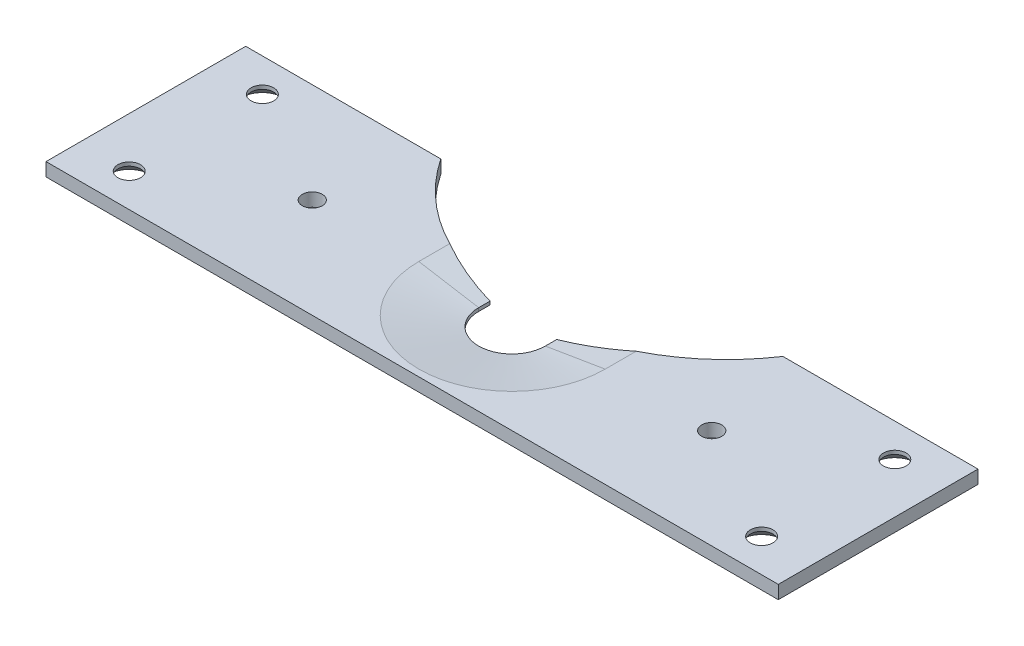
ISO-10303-21;
HEADER;
FILE_DESCRIPTION(('STEP AP214'),'2;1');
FILE_NAME('part.step','',(''),(''),'','','');
FILE_SCHEMA(('AUTOMOTIVE_DESIGN { 1 0 10303 214 1 1 1 1 }'));
ENDSEC;
DATA;
#1=APPLICATION_CONTEXT('core data for automotive mechanical design processes');
#2=APPLICATION_PROTOCOL_DEFINITION('international standard','automotive_design',2000,#1);
#3=PRODUCT_CONTEXT('',#1,'mechanical');
#4=PRODUCT('Part','Part','',(#3));
#5=PRODUCT_RELATED_PRODUCT_CATEGORY('part','',(#4));
#6=PRODUCT_DEFINITION_FORMATION('','',#4);
#7=PRODUCT_DEFINITION_CONTEXT('part definition',#1,'design');
#8=PRODUCT_DEFINITION('design','',#6,#7);
#9=PRODUCT_DEFINITION_SHAPE('','',#8);
#10=(LENGTH_UNIT() NAMED_UNIT(*) SI_UNIT(.MILLI.,.METRE.));
#11=(NAMED_UNIT(*) PLANE_ANGLE_UNIT() SI_UNIT($,.RADIAN.));
#12=(NAMED_UNIT(*) SI_UNIT($,.STERADIAN.) SOLID_ANGLE_UNIT());
#13=UNCERTAINTY_MEASURE_WITH_UNIT(LENGTH_MEASURE(1.E-05),#10,'distance_accuracy_value','');
#14=(GEOMETRIC_REPRESENTATION_CONTEXT(3) GLOBAL_UNCERTAINTY_ASSIGNED_CONTEXT((#13)) GLOBAL_UNIT_ASSIGNED_CONTEXT((#10,
#11,#12)) REPRESENTATION_CONTEXT('',''));
#15=CARTESIAN_POINT('',(0.,0.,0.));
#16=DIRECTION('',(0.,0.,1.));
#17=DIRECTION('',(1.,0.,0.));
#18=AXIS2_PLACEMENT_3D('',#15,#16,#17);
#19=CARTESIAN_POINT('',(-55.,2.,15.));
#20=DIRECTION('',(0.,1.,0.));
#21=DIRECTION('',(0.,0.,1.));
#22=AXIS2_PLACEMENT_3D('',#19,#20,#21);
#23=PLANE('',#22);
#24=CARTESIAN_POINT('',(0.,2.00000000000005,-32.2709623555184));
#25=DIRECTION('',(0.,-1.,0.));
#26=DIRECTION('',(0.,0.,-1.));
#27=AXIS2_PLACEMENT_3D('',#24,#25,#26);
#28=CIRCLE('',#27,30.9632394202983);
#29=CARTESIAN_POINT('',(25.6989504593666,2.00000000000005,-15.));
#30=VERTEX_POINT('',#29);
#31=CARTESIAN_POINT('',(14.0000000000005,2.00000000000005,-4.65353678037294));
#32=VERTEX_POINT('',#31);
#33=EDGE_CURVE('E118',#30,#32,#28,.T.);
#34=ORIENTED_EDGE('',*,*,#33,.T.);
#35=DIRECTION('',(0.,0.,1.));
#36=VECTOR('',#35,1.);
#37=CARTESIAN_POINT('',(14.0000000000002,2.,0.));
#38=LINE('',#37,#36);
#39=CARTESIAN_POINT('',(14.0000000000002,2.,0.));
#40=VERTEX_POINT('',#39);
#41=EDGE_CURVE('E166',#32,#40,#38,.T.);
#42=ORIENTED_EDGE('',*,*,#41,.T.);
#43=CARTESIAN_POINT('',(0.,2.,0.));
#44=DIRECTION('',(0.,1.,0.));
#45=DIRECTION('',(0.,0.,1.));
#46=AXIS2_PLACEMENT_3D('',#43,#44,#45);
#47=CIRCLE('',#46,14.0000000000002);
#48=CARTESIAN_POINT('',(-14.0000000000002,2.,0.));
#49=VERTEX_POINT('',#48);
#50=EDGE_CURVE('E164',#40,#49,#47,.F.);
#51=ORIENTED_EDGE('',*,*,#50,.T.);
#52=DIRECTION('',(0.,0.,-1.));
#53=VECTOR('',#52,1.);
#54=CARTESIAN_POINT('',(-14.0000000000002,2.,-15.));
#55=LINE('',#54,#53);
#56=CARTESIAN_POINT('',(-14.0000000000002,2.,-4.65353678037294));
#57=VERTEX_POINT('',#56);
#58=EDGE_CURVE('E161',#49,#57,#55,.T.);
#59=ORIENTED_EDGE('',*,*,#58,.T.);
#60=CARTESIAN_POINT('',(-25.6989504593666,2.00000000000005,-15.));
#61=VERTEX_POINT('',#60);
#62=EDGE_CURVE('E47',#57,#61,#28,.T.);
#63=ORIENTED_EDGE('',*,*,#62,.T.);
#64=DIRECTION('',(-1.,0.,0.));
#65=VECTOR('',#64,1.);
#66=CARTESIAN_POINT('',(-55.,2.,-15.));
#67=LINE('',#66,#65);
#68=CARTESIAN_POINT('',(-55.,2.,-15.));
#69=VERTEX_POINT('',#68);
#70=EDGE_CURVE('E143',#61,#69,#67,.T.);
#71=ORIENTED_EDGE('',*,*,#70,.T.);
#72=DIRECTION('',(0.,0.,1.));
#73=VECTOR('',#72,1.);
#74=CARTESIAN_POINT('',(-55.,2.,-15.));
#75=LINE('',#74,#73);
#76=CARTESIAN_POINT('',(-55.,2.,15.));
#77=VERTEX_POINT('',#76);
#78=EDGE_CURVE('E222',#69,#77,#75,.T.);
#79=ORIENTED_EDGE('',*,*,#78,.T.);
#80=DIRECTION('',(1.,0.,0.));
#81=VECTOR('',#80,1.);
#82=CARTESIAN_POINT('',(-55.,2.,15.));
#83=LINE('',#82,#81);
#84=CARTESIAN_POINT('',(55.,2.,15.));
#85=VERTEX_POINT('',#84);
#86=EDGE_CURVE('E224',#77,#85,#83,.T.);
#87=ORIENTED_EDGE('',*,*,#86,.T.);
#88=DIRECTION('',(0.,0.,-1.));
#89=VECTOR('',#88,1.);
#90=CARTESIAN_POINT('',(55.,2.,-15.));
#91=LINE('',#90,#89);
#92=CARTESIAN_POINT('',(55.,2.,-15.));
#93=VERTEX_POINT('',#92);
#94=EDGE_CURVE('E140',#85,#93,#91,.T.);
#95=ORIENTED_EDGE('',*,*,#94,.T.);
#96=EDGE_CURVE('E132',#93,#30,#67,.T.);
#97=ORIENTED_EDGE('',*,*,#96,.T.);
#98=EDGE_LOOP('',(#34,#42,#51,#59,#63,#71,#79,#87,#95,#97));
#99=FACE_BOUND('',#98,.T.);
#100=CARTESIAN_POINT('',(29.9999999999998,2.,0.));
#101=DIRECTION('',(0.,1.,0.));
#102=DIRECTION('',(0.,0.,1.));
#103=AXIS2_PLACEMENT_3D('',#100,#101,#102);
#104=CIRCLE('',#103,1.49999999999999);
#105=CARTESIAN_POINT('',(29.9999999999998,2.,1.49999999999994));
#106=VERTEX_POINT('',#105);
#107=EDGE_CURVE('E245',#106,#106,#104,.T.);
#108=ORIENTED_EDGE('',*,*,#107,.F.);
#109=EDGE_LOOP('',(#108));
#110=FACE_BOUND('',#109,.T.);
#111=CARTESIAN_POINT('',(-30.,2.,0.));
#112=DIRECTION('',(0.,1.,0.));
#113=DIRECTION('',(0.,0.,1.));
#114=AXIS2_PLACEMENT_3D('',#111,#112,#113);
#115=CIRCLE('',#114,1.49999999999999);
#116=CARTESIAN_POINT('',(-30.,2.,1.49999999999999));
#117=VERTEX_POINT('',#116);
#118=EDGE_CURVE('E251',#117,#117,#115,.T.);
#119=ORIENTED_EDGE('',*,*,#118,.F.);
#120=EDGE_LOOP('',(#119));
#121=FACE_BOUND('',#120,.T.);
#122=CARTESIAN_POINT('',(-47.5,2.00000000000005,-10.));
#123=DIRECTION('',(0.,-1.,0.));
#124=DIRECTION('',(0.,0.,-1.));
#125=AXIS2_PLACEMENT_3D('',#122,#123,#124);
#126=CIRCLE('',#125,1.7);
#127=CARTESIAN_POINT('',(-47.5,2.00000000000005,-11.7));
#128=VERTEX_POINT('',#127);
#129=EDGE_CURVE('E266',#128,#128,#126,.T.);
#130=ORIENTED_EDGE('',*,*,#129,.T.);
#131=EDGE_LOOP('',(#130));
#132=FACE_BOUND('',#131,.T.);
#133=CARTESIAN_POINT('',(47.5,2.00000000000005,10.));
#134=DIRECTION('',(0.,-1.,0.));
#135=DIRECTION('',(0.,0.,-1.));
#136=AXIS2_PLACEMENT_3D('',#133,#134,#135);
#137=CIRCLE('',#136,1.7);
#138=CARTESIAN_POINT('',(47.5,2.00000000000005,8.3));
#139=VERTEX_POINT('',#138);
#140=EDGE_CURVE('E284',#139,#139,#137,.T.);
#141=ORIENTED_EDGE('',*,*,#140,.T.);
#142=EDGE_LOOP('',(#141));
#143=FACE_BOUND('',#142,.T.);
#144=CARTESIAN_POINT('',(-47.5,2.00000000000005,10.));
#145=DIRECTION('',(0.,-1.,0.));
#146=DIRECTION('',(0.,0.,-1.));
#147=AXIS2_PLACEMENT_3D('',#144,#145,#146);
#148=CIRCLE('',#147,1.7);
#149=CARTESIAN_POINT('',(-47.5,2.00000000000005,8.3));
#150=VERTEX_POINT('',#149);
#151=EDGE_CURVE('E275',#150,#150,#148,.T.);
#152=ORIENTED_EDGE('',*,*,#151,.T.);
#153=EDGE_LOOP('',(#152));
#154=FACE_BOUND('',#153,.T.);
#155=CARTESIAN_POINT('',(47.5,2.00000000000005,-10.));
#156=DIRECTION('',(0.,-1.,0.));
#157=DIRECTION('',(0.,0.,-1.));
#158=AXIS2_PLACEMENT_3D('',#155,#156,#157);
#159=CIRCLE('',#158,1.7);
#160=CARTESIAN_POINT('',(47.5,2.00000000000005,-11.7));
#161=VERTEX_POINT('',#160);
#162=EDGE_CURVE('E257',#161,#161,#159,.T.);
#163=ORIENTED_EDGE('',*,*,#162,.T.);
#164=EDGE_LOOP('',(#163));
#165=FACE_BOUND('',#164,.T.);
#166=ADVANCED_FACE('F32',(#99,#110,#121,#132,#143,#154,#165),#23,.T.);
#167=CARTESIAN_POINT('',(-55.,2.,-15.));
#168=DIRECTION('',(0.,0.,1.));
#169=DIRECTION('',(1.,0.,0.));
#170=AXIS2_PLACEMENT_3D('',#167,#168,#169);
#171=PLANE('',#170);
#172=ORIENTED_EDGE('',*,*,#70,.F.);
#173=DIRECTION('',(0.,-1.,0.));
#174=VECTOR('',#173,1.);
#175=CARTESIAN_POINT('',(-25.6989504593666,2.00000000000005,-15.));
#176=LINE('',#175,#174);
#177=CARTESIAN_POINT('',(-25.6989504593666,0.,-15.));
#178=VERTEX_POINT('',#177);
#179=EDGE_CURVE('E135',#61,#178,#176,.T.);
#180=ORIENTED_EDGE('',*,*,#179,.T.);
#181=DIRECTION('',(-1.,0.,0.));
#182=VECTOR('',#181,1.);
#183=CARTESIAN_POINT('',(-55.,0.,-15.));
#184=LINE('',#183,#182);
#185=CARTESIAN_POINT('',(-55.,0.,-15.));
#186=VERTEX_POINT('',#185);
#187=EDGE_CURVE('E220',#178,#186,#184,.T.);
#188=ORIENTED_EDGE('',*,*,#187,.T.);
#189=DIRECTION('',(0.,-1.,0.));
#190=VECTOR('',#189,1.);
#191=CARTESIAN_POINT('',(-55.,2.,-15.));
#192=LINE('',#191,#190);
#193=EDGE_CURVE('E142',#69,#186,#192,.T.);
#194=ORIENTED_EDGE('',*,*,#193,.F.);
#195=EDGE_LOOP('',(#172,#180,#188,#194));
#196=FACE_BOUND('',#195,.T.);
#197=ADVANCED_FACE('F299',(#196),#171,.F.);
#198=CARTESIAN_POINT('',(-55.,2.,-15.));
#199=DIRECTION('',(1.,0.,0.));
#200=DIRECTION('',(0.,0.,-1.));
#201=AXIS2_PLACEMENT_3D('',#198,#199,#200);
#202=PLANE('',#201);
#203=DIRECTION('',(0.,0.,1.));
#204=VECTOR('',#203,1.);
#205=CARTESIAN_POINT('',(-55.,0.,-15.));
#206=LINE('',#205,#204);
#207=CARTESIAN_POINT('',(-55.,0.,15.));
#208=VERTEX_POINT('',#207);
#209=EDGE_CURVE('E186',#186,#208,#206,.T.);
#210=ORIENTED_EDGE('',*,*,#209,.T.);
#211=DIRECTION('',(0.,-1.,0.));
#212=VECTOR('',#211,1.);
#213=CARTESIAN_POINT('',(-55.,2.,15.));
#214=LINE('',#213,#212);
#215=EDGE_CURVE('E155',#77,#208,#214,.T.);
#216=ORIENTED_EDGE('',*,*,#215,.F.);
#217=ORIENTED_EDGE('',*,*,#78,.F.);
#218=ORIENTED_EDGE('',*,*,#193,.T.);
#219=EDGE_LOOP('',(#210,#216,#217,#218));
#220=FACE_BOUND('',#219,.T.);
#221=ADVANCED_FACE('F34',(#220),#202,.F.);
#222=CARTESIAN_POINT('',(-55.,2.,15.));
#223=DIRECTION('',(0.,0.,-1.));
#224=DIRECTION('',(-1.,0.,0.));
#225=AXIS2_PLACEMENT_3D('',#222,#223,#224);
#226=PLANE('',#225);
#227=DIRECTION('',(1.,0.,0.));
#228=VECTOR('',#227,1.);
#229=CARTESIAN_POINT('',(-55.,0.,15.));
#230=LINE('',#229,#228);
#231=CARTESIAN_POINT('',(55.,0.,15.));
#232=VERTEX_POINT('',#231);
#233=EDGE_CURVE('E216',#208,#232,#230,.T.);
#234=ORIENTED_EDGE('',*,*,#233,.T.);
#235=DIRECTION('',(0.,-1.,0.));
#236=VECTOR('',#235,1.);
#237=CARTESIAN_POINT('',(55.,2.,15.));
#238=LINE('',#237,#236);
#239=EDGE_CURVE('E152',#85,#232,#238,.T.);
#240=ORIENTED_EDGE('',*,*,#239,.F.);
#241=ORIENTED_EDGE('',*,*,#86,.F.);
#242=ORIENTED_EDGE('',*,*,#215,.T.);
#243=EDGE_LOOP('',(#234,#240,#241,#242));
#244=FACE_BOUND('',#243,.T.);
#245=ADVANCED_FACE('F229',(#244),#226,.F.);
#246=CARTESIAN_POINT('',(55.,2.,-15.));
#247=DIRECTION('',(-1.,0.,0.));
#248=DIRECTION('',(0.,0.,1.));
#249=AXIS2_PLACEMENT_3D('',#246,#247,#248);
#250=PLANE('',#249);
#251=DIRECTION('',(0.,0.,-1.));
#252=VECTOR('',#251,1.);
#253=CARTESIAN_POINT('',(55.,0.,-15.));
#254=LINE('',#253,#252);
#255=CARTESIAN_POINT('',(55.,0.,-15.));
#256=VERTEX_POINT('',#255);
#257=EDGE_CURVE('E218',#232,#256,#254,.T.);
#258=ORIENTED_EDGE('',*,*,#257,.T.);
#259=DIRECTION('',(0.,-1.,0.));
#260=VECTOR('',#259,1.);
#261=CARTESIAN_POINT('',(55.,2.,-15.));
#262=LINE('',#261,#260);
#263=EDGE_CURVE('E146',#93,#256,#262,.T.);
#264=ORIENTED_EDGE('',*,*,#263,.F.);
#265=ORIENTED_EDGE('',*,*,#94,.F.);
#266=ORIENTED_EDGE('',*,*,#239,.T.);
#267=EDGE_LOOP('',(#258,#264,#265,#266));
#268=FACE_BOUND('',#267,.T.);
#269=ADVANCED_FACE('F232',(#268),#250,.F.);
#270=CARTESIAN_POINT('',(25.6989504593666,0.,-15.));
#271=VERTEX_POINT('',#270);
#272=EDGE_CURVE('E134',#256,#271,#184,.T.);
#273=ORIENTED_EDGE('',*,*,#272,.T.);
#274=DIRECTION('',(0.,-1.,0.));
#275=VECTOR('',#274,1.);
#276=CARTESIAN_POINT('',(25.6989504593666,2.00000000000005,-15.));
#277=LINE('',#276,#275);
#278=EDGE_CURVE('E121',#271,#30,#277,.F.);
#279=ORIENTED_EDGE('',*,*,#278,.T.);
#280=ORIENTED_EDGE('',*,*,#96,.F.);
#281=ORIENTED_EDGE('',*,*,#263,.T.);
#282=EDGE_LOOP('',(#273,#279,#280,#281));
#283=FACE_BOUND('',#282,.T.);
#284=ADVANCED_FACE('F130',(#283),#171,.F.);
#285=CARTESIAN_POINT('',(-55.,0.,15.));
#286=DIRECTION('',(0.,1.,0.));
#287=DIRECTION('',(0.,0.,1.));
#288=AXIS2_PLACEMENT_3D('',#285,#286,#287);
#289=PLANE('',#288);
#290=CARTESIAN_POINT('',(29.9999999999998,0.,0.));
#291=DIRECTION('',(0.,1.,0.));
#292=DIRECTION('',(0.,0.,1.));
#293=AXIS2_PLACEMENT_3D('',#290,#291,#292);
#294=CIRCLE('',#293,1.5);
#295=CARTESIAN_POINT('',(29.9999999999998,0.,1.49999999999995));
#296=VERTEX_POINT('',#295);
#297=EDGE_CURVE('E248',#296,#296,#294,.T.);
#298=ORIENTED_EDGE('',*,*,#297,.T.);
#299=EDGE_LOOP('',(#298));
#300=FACE_BOUND('',#299,.T.);
#301=CARTESIAN_POINT('',(-30.,0.,0.));
#302=DIRECTION('',(0.,1.,0.));
#303=DIRECTION('',(0.,0.,1.));
#304=AXIS2_PLACEMENT_3D('',#301,#302,#303);
#305=CIRCLE('',#304,1.5);
#306=CARTESIAN_POINT('',(-30.,0.,1.5));
#307=VERTEX_POINT('',#306);
#308=EDGE_CURVE('E254',#307,#307,#305,.T.);
#309=ORIENTED_EDGE('',*,*,#308,.T.);
#310=EDGE_LOOP('',(#309));
#311=FACE_BOUND('',#310,.T.);
#312=CARTESIAN_POINT('',(47.5,0.,-10.));
#313=DIRECTION('',(0.,-1.,0.));
#314=DIRECTION('',(0.,0.,-1.));
#315=AXIS2_PLACEMENT_3D('',#312,#313,#314);
#316=CIRCLE('',#315,3.15);
#317=CARTESIAN_POINT('',(47.5,0.,-13.15));
#318=VERTEX_POINT('',#317);
#319=EDGE_CURVE('E263',#318,#318,#316,.T.);
#320=ORIENTED_EDGE('',*,*,#319,.F.);
#321=EDGE_LOOP('',(#320));
#322=FACE_BOUND('',#321,.T.);
#323=CARTESIAN_POINT('',(-47.5,0.,-10.));
#324=DIRECTION('',(0.,-1.,0.));
#325=DIRECTION('',(0.,0.,-1.));
#326=AXIS2_PLACEMENT_3D('',#323,#324,#325);
#327=CIRCLE('',#326,3.15);
#328=CARTESIAN_POINT('',(-47.5,0.,-13.15));
#329=VERTEX_POINT('',#328);
#330=EDGE_CURVE('E272',#329,#329,#327,.T.);
#331=ORIENTED_EDGE('',*,*,#330,.F.);
#332=EDGE_LOOP('',(#331));
#333=FACE_BOUND('',#332,.T.);
#334=CARTESIAN_POINT('',(-47.5,0.,10.));
#335=DIRECTION('',(0.,-1.,0.));
#336=DIRECTION('',(0.,0.,-1.));
#337=AXIS2_PLACEMENT_3D('',#334,#335,#336);
#338=CIRCLE('',#337,3.15);
#339=CARTESIAN_POINT('',(-47.5,0.,6.85));
#340=VERTEX_POINT('',#339);
#341=EDGE_CURVE('E281',#340,#340,#338,.T.);
#342=ORIENTED_EDGE('',*,*,#341,.F.);
#343=EDGE_LOOP('',(#342));
#344=FACE_BOUND('',#343,.T.);
#345=CARTESIAN_POINT('',(47.5,0.,10.));
#346=DIRECTION('',(0.,-1.,0.));
#347=DIRECTION('',(0.,0.,-1.));
#348=AXIS2_PLACEMENT_3D('',#345,#346,#347);
#349=CIRCLE('',#348,3.15);
#350=CARTESIAN_POINT('',(47.5,0.,6.85));
#351=VERTEX_POINT('',#350);
#352=EDGE_CURVE('E202',#351,#351,#349,.T.);
#353=ORIENTED_EDGE('',*,*,#352,.F.);
#354=EDGE_LOOP('',(#353));
#355=FACE_BOUND('',#354,.T.);
#356=DIRECTION('',(0.,0.,-1.));
#357=VECTOR('',#356,1.);
#358=CARTESIAN_POINT('',(5.,0.,0.));
#359=LINE('',#358,#357);
#360=CARTESIAN_POINT('',(5.,0.,0.));
#361=VERTEX_POINT('',#360);
#362=CARTESIAN_POINT('',(5.,0.,-1.71409413577583));
#363=VERTEX_POINT('',#362);
#364=EDGE_CURVE('E209',#361,#363,#359,.T.);
#365=ORIENTED_EDGE('',*,*,#364,.T.);
#366=CARTESIAN_POINT('',(0.,0.,-32.2709623555184));
#367=DIRECTION('',(0.,-1.,0.));
#368=DIRECTION('',(0.,0.,-1.));
#369=AXIS2_PLACEMENT_3D('',#366,#367,#368);
#370=CIRCLE('',#369,30.9632394202983);
#371=EDGE_CURVE('E235',#271,#363,#370,.T.);
#372=ORIENTED_EDGE('',*,*,#371,.F.);
#373=ORIENTED_EDGE('',*,*,#272,.F.);
#374=ORIENTED_EDGE('',*,*,#257,.F.);
#375=ORIENTED_EDGE('',*,*,#233,.F.);
#376=ORIENTED_EDGE('',*,*,#209,.F.);
#377=ORIENTED_EDGE('',*,*,#187,.F.);
#378=CARTESIAN_POINT('',(-5.,0.,-1.71409413577583));
#379=VERTEX_POINT('',#378);
#380=EDGE_CURVE('E236',#379,#178,#370,.T.);
#381=ORIENTED_EDGE('',*,*,#380,.F.);
#382=DIRECTION('',(0.,0.,1.));
#383=VECTOR('',#382,1.);
#384=CARTESIAN_POINT('',(-5.,0.,0.));
#385=LINE('',#384,#383);
#386=CARTESIAN_POINT('',(-5.,0.,0.));
#387=VERTEX_POINT('',#386);
#388=EDGE_CURVE('E210',#379,#387,#385,.T.);
#389=ORIENTED_EDGE('',*,*,#388,.T.);
#390=CARTESIAN_POINT('',(0.,0.,0.));
#391=DIRECTION('',(0.,1.,0.));
#392=DIRECTION('',(0.,0.,1.));
#393=AXIS2_PLACEMENT_3D('',#390,#391,#392);
#394=CIRCLE('',#393,5.);
#395=EDGE_CURVE('E185',#387,#361,#394,.T.);
#396=ORIENTED_EDGE('',*,*,#395,.T.);
#397=EDGE_LOOP('',(#365,#372,#373,#374,#375,#376,#377,#381,#389,#396));
#398=FACE_BOUND('',#397,.T.);
#399=ADVANCED_FACE('F234',(#300,#311,#322,#333,#344,#355,#398),#289,.F.);
#400=CARTESIAN_POINT('',(0.,0.,0.));
#401=DIRECTION('',(0.,1.,0.));
#402=DIRECTION('',(0.,0.,1.));
#403=AXIS2_PLACEMENT_3D('',#400,#401,#402);
#404=CYLINDRICAL_SURFACE('',#403,5.);
#405=DIRECTION('',(0.,1.,0.));
#406=VECTOR('',#405,1.);
#407=CARTESIAN_POINT('',(-5.,0.,0.));
#408=LINE('',#407,#406);
#409=CARTESIAN_POINT('',(-5.,0.499999999999999,0.));
#410=VERTEX_POINT('',#409);
#411=EDGE_CURVE('E176',#387,#410,#408,.T.);
#412=ORIENTED_EDGE('',*,*,#411,.T.);
#413=CARTESIAN_POINT('',(0.,0.499999999999999,0.));
#414=DIRECTION('',(0.,1.,0.));
#415=DIRECTION('',(0.,0.,1.));
#416=AXIS2_PLACEMENT_3D('',#413,#414,#415);
#417=CIRCLE('',#416,5.);
#418=CARTESIAN_POINT('',(5.,0.499999999999999,0.));
#419=VERTEX_POINT('',#418);
#420=EDGE_CURVE('E168',#410,#419,#417,.T.);
#421=ORIENTED_EDGE('',*,*,#420,.T.);
#422=DIRECTION('',(0.,1.,0.));
#423=VECTOR('',#422,1.);
#424=CARTESIAN_POINT('',(5.,0.,0.));
#425=LINE('',#424,#423);
#426=EDGE_CURVE('E187',#361,#419,#425,.T.);
#427=ORIENTED_EDGE('',*,*,#426,.F.);
#428=ORIENTED_EDGE('',*,*,#395,.F.);
#429=EDGE_LOOP('',(#412,#421,#427,#428));
#430=FACE_BOUND('',#429,.T.);
#431=ADVANCED_FACE('F181',(#430),#404,.F.);
#432=CARTESIAN_POINT('',(-5.,0.,0.));
#433=DIRECTION('',(-1.,0.,0.));
#434=DIRECTION('',(0.,0.,1.));
#435=AXIS2_PLACEMENT_3D('',#432,#433,#434);
#436=PLANE('',#435);
#437=ORIENTED_EDGE('',*,*,#388,.F.);
#438=DIRECTION('',(0.,-1.,0.));
#439=VECTOR('',#438,1.);
#440=CARTESIAN_POINT('',(-5.,2.00000000000005,-1.71409413577583));
#441=LINE('',#440,#439);
#442=CARTESIAN_POINT('',(-5.,0.499999999999999,-1.71409413577583));
#443=VERTEX_POINT('',#442);
#444=EDGE_CURVE('E136',#379,#443,#441,.F.);
#445=ORIENTED_EDGE('',*,*,#444,.T.);
#446=DIRECTION('',(0.,0.,1.));
#447=VECTOR('',#446,1.);
#448=CARTESIAN_POINT('',(-5.,0.499999999999999,0.));
#449=LINE('',#448,#447);
#450=EDGE_CURVE('E40',#443,#410,#449,.T.);
#451=ORIENTED_EDGE('',*,*,#450,.T.);
#452=ORIENTED_EDGE('',*,*,#411,.F.);
#453=EDGE_LOOP('',(#437,#445,#451,#452));
#454=FACE_BOUND('',#453,.T.);
#455=ADVANCED_FACE('F175',(#454),#436,.F.);
#456=CARTESIAN_POINT('',(5.,0.,0.));
#457=DIRECTION('',(1.,0.,0.));
#458=DIRECTION('',(0.,0.,-1.));
#459=AXIS2_PLACEMENT_3D('',#456,#457,#458);
#460=PLANE('',#459);
#461=DIRECTION('',(0.,0.,-1.));
#462=VECTOR('',#461,1.);
#463=CARTESIAN_POINT('',(5.,0.499999999999999,-15.));
#464=LINE('',#463,#462);
#465=CARTESIAN_POINT('',(5.,0.499999999999999,-1.71409413577583));
#466=VERTEX_POINT('',#465);
#467=EDGE_CURVE('E158',#419,#466,#464,.T.);
#468=ORIENTED_EDGE('',*,*,#467,.T.);
#469=DIRECTION('',(0.,-1.,0.));
#470=VECTOR('',#469,1.);
#471=CARTESIAN_POINT('',(5.,2.00000000000005,-1.71409413577583));
#472=LINE('',#471,#470);
#473=EDGE_CURVE('E54',#466,#363,#472,.T.);
#474=ORIENTED_EDGE('',*,*,#473,.T.);
#475=ORIENTED_EDGE('',*,*,#364,.F.);
#476=ORIENTED_EDGE('',*,*,#426,.T.);
#477=EDGE_LOOP('',(#468,#474,#475,#476));
#478=FACE_BOUND('',#477,.T.);
#479=ADVANCED_FACE('F206',(#478),#460,.F.);
#480=CARTESIAN_POINT('',(-5.,0.499999999999999,0.));
#481=DIRECTION('',(0.164398987305354,0.986393923832144,0.));
#482=DIRECTION('',(-0.986393923832144,0.164398987305354,0.));
#483=AXIS2_PLACEMENT_3D('',#480,#481,#482);
#484=PLANE('',#483);
#485=CARTESIAN_POINT('',(0.,-0.333333333333316,-32.2709623555184));
#486=DIRECTION('',(0.164398987305354,0.986393923832144,0.));
#487=DIRECTION('',(0.986393923832144,-0.164398987305354,0.));
#488=AXIS2_PLACEMENT_3D('',#485,#486,#487);
#489=ELLIPSE('',#488,31.3903387604072,30.9632394202983);
#490=EDGE_CURVE('E240',#57,#443,#489,.T.);
#491=ORIENTED_EDGE('',*,*,#490,.F.);
#492=ORIENTED_EDGE('',*,*,#58,.F.);
#493=DIRECTION('',(-0.986393923832144,0.164398987305354,0.));
#494=VECTOR('',#493,1.);
#495=CARTESIAN_POINT('',(-5.,0.499999999999999,0.));
#496=LINE('',#495,#494);
#497=EDGE_CURVE('E191',#410,#49,#496,.T.);
#498=ORIENTED_EDGE('',*,*,#497,.F.);
#499=ORIENTED_EDGE('',*,*,#450,.F.);
#500=EDGE_LOOP('',(#491,#492,#498,#499));
#501=FACE_BOUND('',#500,.T.);
#502=ADVANCED_FACE('F192',(#501),#484,.T.);
#503=CARTESIAN_POINT('',(0.,0.499999999999999,0.));
#504=DIRECTION('',(0.,1.,0.));
#505=DIRECTION('',(0.,0.,1.));
#506=AXIS2_PLACEMENT_3D('',#503,#504,#505);
#507=CONICAL_SURFACE('',#506,5.,1.40564764938027);
#508=ORIENTED_EDGE('',*,*,#497,.T.);
#509=ORIENTED_EDGE('',*,*,#50,.F.);
#510=DIRECTION('',(0.986393923832144,0.164398987305354,0.));
#511=VECTOR('',#510,1.);
#512=CARTESIAN_POINT('',(5.,0.499999999999999,0.));
#513=LINE('',#512,#511);
#514=EDGE_CURVE('E195',#419,#40,#513,.T.);
#515=ORIENTED_EDGE('',*,*,#514,.F.);
#516=ORIENTED_EDGE('',*,*,#420,.F.);
#517=EDGE_LOOP('',(#508,#509,#515,#516));
#518=FACE_BOUND('',#517,.T.);
#519=ADVANCED_FACE('F198',(#518),#507,.F.);
#520=CARTESIAN_POINT('',(5.,0.499999999999999,0.));
#521=DIRECTION('',(-0.164398987305354,0.986393923832144,0.));
#522=DIRECTION('',(-0.986393923832144,-0.164398987305354,0.));
#523=AXIS2_PLACEMENT_3D('',#520,#521,#522);
#524=PLANE('',#523);
#525=CARTESIAN_POINT('',(0.,-0.333333333333316,-32.2709623555184));
#526=DIRECTION('',(-0.164398987305354,0.986393923832144,0.));
#527=DIRECTION('',(-0.986393923832144,-0.164398987305354,0.));
#528=AXIS2_PLACEMENT_3D('',#525,#526,#527);
#529=ELLIPSE('',#528,31.3903387604072,30.9632394202983);
#530=EDGE_CURVE('E11',#466,#32,#529,.T.);
#531=ORIENTED_EDGE('',*,*,#530,.F.);
#532=ORIENTED_EDGE('',*,*,#467,.F.);
#533=ORIENTED_EDGE('',*,*,#514,.T.);
#534=ORIENTED_EDGE('',*,*,#41,.F.);
#535=EDGE_LOOP('',(#531,#532,#533,#534));
#536=FACE_BOUND('',#535,.T.);
#537=ADVANCED_FACE('F204',(#536),#524,.T.);
#538=CARTESIAN_POINT('',(47.5,0.,10.));
#539=DIRECTION('',(0.,-1.,0.));
#540=DIRECTION('',(0.,0.,-1.));
#541=AXIS2_PLACEMENT_3D('',#538,#539,#540);
#542=CONICAL_SURFACE('',#541,3.15,0.785398163397449);
#543=CARTESIAN_POINT('',(47.5,1.45,10.));
#544=DIRECTION('',(0.,-1.,0.));
#545=DIRECTION('',(0.,0.,-1.));
#546=AXIS2_PLACEMENT_3D('',#543,#544,#545);
#547=CIRCLE('',#546,1.7);
#548=CARTESIAN_POINT('',(47.5,1.45,8.3));
#549=VERTEX_POINT('',#548);
#550=EDGE_CURVE('E287',#549,#549,#547,.T.);
#551=ORIENTED_EDGE('',*,*,#550,.F.);
#552=EDGE_LOOP('',(#551));
#553=FACE_BOUND('',#552,.T.);
#554=ORIENTED_EDGE('',*,*,#352,.T.);
#555=EDGE_LOOP('',(#554));
#556=FACE_BOUND('',#555,.T.);
#557=ADVANCED_FACE('F368',(#553,#556),#542,.F.);
#558=CARTESIAN_POINT('',(47.5,0.,10.));
#559=DIRECTION('',(0.,-1.,0.));
#560=DIRECTION('',(0.,0.,-1.));
#561=AXIS2_PLACEMENT_3D('',#558,#559,#560);
#562=CYLINDRICAL_SURFACE('',#561,1.7);
#563=ORIENTED_EDGE('',*,*,#140,.F.);
#564=EDGE_LOOP('',(#563));
#565=FACE_BOUND('',#564,.T.);
#566=ORIENTED_EDGE('',*,*,#550,.T.);
#567=EDGE_LOOP('',(#566));
#568=FACE_BOUND('',#567,.T.);
#569=ADVANCED_FACE('F375',(#565,#568),#562,.F.);
#570=CARTESIAN_POINT('',(-47.5,0.,10.));
#571=DIRECTION('',(0.,-1.,0.));
#572=DIRECTION('',(0.,0.,-1.));
#573=AXIS2_PLACEMENT_3D('',#570,#571,#572);
#574=CONICAL_SURFACE('',#573,3.15,0.785398163397449);
#575=CARTESIAN_POINT('',(-47.5,1.45,10.));
#576=DIRECTION('',(0.,-1.,0.));
#577=DIRECTION('',(0.,0.,-1.));
#578=AXIS2_PLACEMENT_3D('',#575,#576,#577);
#579=CIRCLE('',#578,1.7);
#580=CARTESIAN_POINT('',(-47.5,1.45,8.3));
#581=VERTEX_POINT('',#580);
#582=EDGE_CURVE('E278',#581,#581,#579,.T.);
#583=ORIENTED_EDGE('',*,*,#582,.F.);
#584=EDGE_LOOP('',(#583));
#585=FACE_BOUND('',#584,.T.);
#586=ORIENTED_EDGE('',*,*,#341,.T.);
#587=EDGE_LOOP('',(#586));
#588=FACE_BOUND('',#587,.T.);
#589=ADVANCED_FACE('F383',(#585,#588),#574,.F.);
#590=CARTESIAN_POINT('',(-47.5,0.,10.));
#591=DIRECTION('',(0.,-1.,0.));
#592=DIRECTION('',(0.,0.,-1.));
#593=AXIS2_PLACEMENT_3D('',#590,#591,#592);
#594=CYLINDRICAL_SURFACE('',#593,1.7);
#595=ORIENTED_EDGE('',*,*,#151,.F.);
#596=EDGE_LOOP('',(#595));
#597=FACE_BOUND('',#596,.T.);
#598=ORIENTED_EDGE('',*,*,#582,.T.);
#599=EDGE_LOOP('',(#598));
#600=FACE_BOUND('',#599,.T.);
#601=ADVANCED_FACE('F391',(#597,#600),#594,.F.);
#602=CARTESIAN_POINT('',(-47.5,0.,-10.));
#603=DIRECTION('',(0.,-1.,0.));
#604=DIRECTION('',(0.,0.,-1.));
#605=AXIS2_PLACEMENT_3D('',#602,#603,#604);
#606=CONICAL_SURFACE('',#605,3.15,0.785398163397449);
#607=CARTESIAN_POINT('',(-47.5,1.45,-10.));
#608=DIRECTION('',(0.,-1.,0.));
#609=DIRECTION('',(0.,0.,-1.));
#610=AXIS2_PLACEMENT_3D('',#607,#608,#609);
#611=CIRCLE('',#610,1.7);
#612=CARTESIAN_POINT('',(-47.5,1.45,-11.7));
#613=VERTEX_POINT('',#612);
#614=EDGE_CURVE('E269',#613,#613,#611,.T.);
#615=ORIENTED_EDGE('',*,*,#614,.F.);
#616=EDGE_LOOP('',(#615));
#617=FACE_BOUND('',#616,.T.);
#618=ORIENTED_EDGE('',*,*,#330,.T.);
#619=EDGE_LOOP('',(#618));
#620=FACE_BOUND('',#619,.T.);
#621=ADVANCED_FACE('F399',(#617,#620),#606,.F.);
#622=CARTESIAN_POINT('',(-47.5,0.,-10.));
#623=DIRECTION('',(0.,-1.,0.));
#624=DIRECTION('',(0.,0.,-1.));
#625=AXIS2_PLACEMENT_3D('',#622,#623,#624);
#626=CYLINDRICAL_SURFACE('',#625,1.7);
#627=ORIENTED_EDGE('',*,*,#129,.F.);
#628=EDGE_LOOP('',(#627));
#629=FACE_BOUND('',#628,.T.);
#630=ORIENTED_EDGE('',*,*,#614,.T.);
#631=EDGE_LOOP('',(#630));
#632=FACE_BOUND('',#631,.T.);
#633=ADVANCED_FACE('F407',(#629,#632),#626,.F.);
#634=CARTESIAN_POINT('',(47.5,0.,-10.));
#635=DIRECTION('',(0.,-1.,0.));
#636=DIRECTION('',(0.,0.,-1.));
#637=AXIS2_PLACEMENT_3D('',#634,#635,#636);
#638=CONICAL_SURFACE('',#637,3.15,0.785398163397449);
#639=CARTESIAN_POINT('',(47.5,1.45,-10.));
#640=DIRECTION('',(0.,-1.,0.));
#641=DIRECTION('',(0.,0.,-1.));
#642=AXIS2_PLACEMENT_3D('',#639,#640,#641);
#643=CIRCLE('',#642,1.7);
#644=CARTESIAN_POINT('',(47.5,1.45,-11.7));
#645=VERTEX_POINT('',#644);
#646=EDGE_CURVE('E260',#645,#645,#643,.T.);
#647=ORIENTED_EDGE('',*,*,#646,.F.);
#648=EDGE_LOOP('',(#647));
#649=FACE_BOUND('',#648,.T.);
#650=ORIENTED_EDGE('',*,*,#319,.T.);
#651=EDGE_LOOP('',(#650));
#652=FACE_BOUND('',#651,.T.);
#653=ADVANCED_FACE('F415',(#649,#652),#638,.F.);
#654=CARTESIAN_POINT('',(47.5,0.,-10.));
#655=DIRECTION('',(0.,-1.,0.));
#656=DIRECTION('',(0.,0.,-1.));
#657=AXIS2_PLACEMENT_3D('',#654,#655,#656);
#658=CYLINDRICAL_SURFACE('',#657,1.7);
#659=ORIENTED_EDGE('',*,*,#162,.F.);
#660=EDGE_LOOP('',(#659));
#661=FACE_BOUND('',#660,.T.);
#662=ORIENTED_EDGE('',*,*,#646,.T.);
#663=EDGE_LOOP('',(#662));
#664=FACE_BOUND('',#663,.T.);
#665=ADVANCED_FACE('F423',(#661,#664),#658,.F.);
#666=CARTESIAN_POINT('',(-30.,2.,0.));
#667=DIRECTION('',(0.,1.,0.));
#668=DIRECTION('',(0.,0.,1.));
#669=AXIS2_PLACEMENT_3D('',#666,#667,#668);
#670=CYLINDRICAL_SURFACE('',#669,1.49999999999999);
#671=ORIENTED_EDGE('',*,*,#308,.F.);
#672=EDGE_LOOP('',(#671));
#673=FACE_BOUND('',#672,.T.);
#674=ORIENTED_EDGE('',*,*,#118,.T.);
#675=EDGE_LOOP('',(#674));
#676=FACE_BOUND('',#675,.T.);
#677=ADVANCED_FACE('F431',(#673,#676),#670,.F.);
#678=CARTESIAN_POINT('',(29.9999999999998,2.,0.));
#679=DIRECTION('',(0.,1.,0.));
#680=DIRECTION('',(0.,0.,1.));
#681=AXIS2_PLACEMENT_3D('',#678,#679,#680);
#682=CYLINDRICAL_SURFACE('',#681,1.49999999999999);
#683=ORIENTED_EDGE('',*,*,#297,.F.);
#684=EDGE_LOOP('',(#683));
#685=FACE_BOUND('',#684,.T.);
#686=ORIENTED_EDGE('',*,*,#107,.T.);
#687=EDGE_LOOP('',(#686));
#688=FACE_BOUND('',#687,.T.);
#689=ADVANCED_FACE('F439',(#685,#688),#682,.F.);
#690=CARTESIAN_POINT('',(0.,2.00000000000005,-32.2709623555184));
#691=DIRECTION('',(0.,-1.,0.));
#692=DIRECTION('',(0.,0.,-1.));
#693=AXIS2_PLACEMENT_3D('',#690,#691,#692);
#694=CYLINDRICAL_SURFACE('',#693,30.9632394202983);
#695=ORIENTED_EDGE('',*,*,#371,.T.);
#696=ORIENTED_EDGE('',*,*,#473,.F.);
#697=ORIENTED_EDGE('',*,*,#530,.T.);
#698=ORIENTED_EDGE('',*,*,#33,.F.);
#699=ORIENTED_EDGE('',*,*,#278,.F.);
#700=EDGE_LOOP('',(#695,#696,#697,#698,#699));
#701=FACE_BOUND('',#700,.T.);
#702=ADVANCED_FACE('F120',(#701),#694,.F.);
#703=ORIENTED_EDGE('',*,*,#62,.F.);
#704=ORIENTED_EDGE('',*,*,#490,.T.);
#705=ORIENTED_EDGE('',*,*,#444,.F.);
#706=ORIENTED_EDGE('',*,*,#380,.T.);
#707=ORIENTED_EDGE('',*,*,#179,.F.);
#708=EDGE_LOOP('',(#703,#704,#705,#706,#707));
#709=FACE_BOUND('',#708,.T.);
#710=ADVANCED_FACE('F296',(#709),#694,.F.);
#711=CLOSED_SHELL('',(#166,#197,#221,#245,#269,#284,#399,#431,#455,#479,#502,#519,#537,#557,
#569,#589,#601,#621,#633,#653,#665,#677,#689,#702,#710));
#712=MANIFOLD_SOLID_BREP('B2',#711);
#713=ADVANCED_BREP_SHAPE_REPRESENTATION('',(#18,#712),#14);
#714=SHAPE_DEFINITION_REPRESENTATION(#9,#713);
ENDSEC;
END-ISO-10303-21;
